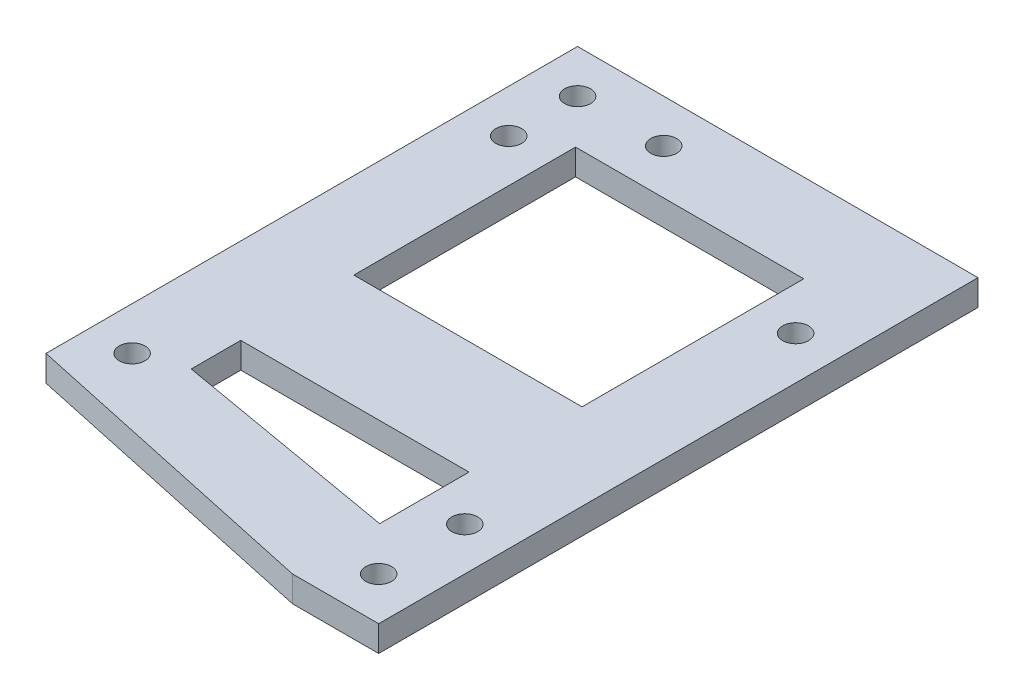
ISO-10303-21;
HEADER;
FILE_DESCRIPTION(('STEP AP214'),'2;1');
FILE_NAME('part.step','',(''),(''),'','','');
FILE_SCHEMA(('AUTOMOTIVE_DESIGN { 1 0 10303 214 1 1 1 1 }'));
ENDSEC;
DATA;
#1=APPLICATION_CONTEXT('core data for automotive mechanical design processes');
#2=APPLICATION_PROTOCOL_DEFINITION('international standard','automotive_design',2000,#1);
#3=PRODUCT_CONTEXT('',#1,'mechanical');
#4=PRODUCT('Part','Part','',(#3));
#5=PRODUCT_RELATED_PRODUCT_CATEGORY('part','',(#4));
#6=PRODUCT_DEFINITION_FORMATION('','',#4);
#7=PRODUCT_DEFINITION_CONTEXT('part definition',#1,'design');
#8=PRODUCT_DEFINITION('design','',#6,#7);
#9=PRODUCT_DEFINITION_SHAPE('','',#8);
#10=(LENGTH_UNIT() NAMED_UNIT(*) SI_UNIT(.MILLI.,.METRE.));
#11=(NAMED_UNIT(*) PLANE_ANGLE_UNIT() SI_UNIT($,.RADIAN.));
#12=(NAMED_UNIT(*) SI_UNIT($,.STERADIAN.) SOLID_ANGLE_UNIT());
#13=UNCERTAINTY_MEASURE_WITH_UNIT(LENGTH_MEASURE(1.E-05),#10,'distance_accuracy_value','');
#14=(GEOMETRIC_REPRESENTATION_CONTEXT(3) GLOBAL_UNCERTAINTY_ASSIGNED_CONTEXT((#13)) GLOBAL_UNIT_ASSIGNED_CONTEXT((#10,
#11,#12)) REPRESENTATION_CONTEXT('',''));
#15=CARTESIAN_POINT('',(0.,0.,0.));
#16=DIRECTION('',(0.,0.,1.));
#17=DIRECTION('',(1.,0.,0.));
#18=AXIS2_PLACEMENT_3D('',#15,#16,#17);
#19=CARTESIAN_POINT('',(31.5,3.,0.));
#20=DIRECTION('',(1.,0.,0.));
#21=DIRECTION('',(0.,0.,1.));
#22=AXIS2_PLACEMENT_3D('',#19,#20,#21);
#23=PLANE('',#22);
#24=DIRECTION('',(0.,0.,-1.));
#25=VECTOR('',#24,1.);
#26=CARTESIAN_POINT('',(31.5,0.,0.));
#27=LINE('',#26,#25);
#28=CARTESIAN_POINT('',(31.5,0.,54.4800000000001));
#29=VERTEX_POINT('',#28);
#30=CARTESIAN_POINT('',(31.5,0.,44.1090614886732));
#31=VERTEX_POINT('',#30);
#32=EDGE_CURVE('E163',#29,#31,#27,.T.);
#33=ORIENTED_EDGE('',*,*,#32,.F.);
#34=DIRECTION('',(0.,-1.,0.));
#35=VECTOR('',#34,1.);
#36=CARTESIAN_POINT('',(31.5,3.,54.4800000000001));
#37=LINE('',#36,#35);
#38=CARTESIAN_POINT('',(31.5,3.,54.4800000000001));
#39=VERTEX_POINT('',#38);
#40=EDGE_CURVE('E143',#39,#29,#37,.T.);
#41=ORIENTED_EDGE('',*,*,#40,.F.);
#42=DIRECTION('',(0.,0.,-1.));
#43=VECTOR('',#42,1.);
#44=CARTESIAN_POINT('',(31.5,3.,0.));
#45=LINE('',#44,#43);
#46=CARTESIAN_POINT('',(31.5,3.,44.1090614886732));
#47=VERTEX_POINT('',#46);
#48=EDGE_CURVE('E152',#39,#47,#45,.T.);
#49=ORIENTED_EDGE('',*,*,#48,.T.);
#50=DIRECTION('',(0.,1.,0.));
#51=VECTOR('',#50,1.);
#52=CARTESIAN_POINT('',(31.5,0.,44.1090614886732));
#53=LINE('',#52,#51);
#54=EDGE_CURVE('E212',#31,#47,#53,.T.);
#55=ORIENTED_EDGE('',*,*,#54,.F.);
#56=EDGE_LOOP('',(#33,#41,#49,#55));
#57=FACE_BOUND('',#56,.T.);
#58=ADVANCED_FACE('F43',(#57),#23,.F.);
#59=CARTESIAN_POINT('',(5.,3.,0.));
#60=DIRECTION('',(1.,0.,0.));
#61=DIRECTION('',(0.,0.,1.));
#62=AXIS2_PLACEMENT_3D('',#59,#60,#61);
#63=PLANE('',#62);
#64=DIRECTION('',(0.,1.,0.));
#65=VECTOR('',#64,1.);
#66=CARTESIAN_POINT('',(5.,0.,49.8670785525155));
#67=LINE('',#66,#65);
#68=CARTESIAN_POINT('',(5.,0.,49.8670785525155));
#69=VERTEX_POINT('',#68);
#70=CARTESIAN_POINT('',(5.,3.,49.8670785525155));
#71=VERTEX_POINT('',#70);
#72=EDGE_CURVE('E146',#69,#71,#67,.T.);
#73=ORIENTED_EDGE('',*,*,#72,.F.);
#74=DIRECTION('',(0.,0.,-1.));
#75=VECTOR('',#74,1.);
#76=CARTESIAN_POINT('',(5.,0.,0.));
#77=LINE('',#76,#75);
#78=CARTESIAN_POINT('',(5.,0.,44.1090614886732));
#79=VERTEX_POINT('',#78);
#80=EDGE_CURVE('E274',#69,#79,#77,.T.);
#81=ORIENTED_EDGE('',*,*,#80,.T.);
#82=DIRECTION('',(0.,1.,0.));
#83=VECTOR('',#82,1.);
#84=CARTESIAN_POINT('',(5.,0.,44.1090614886732));
#85=LINE('',#84,#83);
#86=CARTESIAN_POINT('',(5.,3.,44.1090614886732));
#87=VERTEX_POINT('',#86);
#88=EDGE_CURVE('E208',#79,#87,#85,.T.);
#89=ORIENTED_EDGE('',*,*,#88,.T.);
#90=DIRECTION('',(0.,0.,-1.));
#91=VECTOR('',#90,1.);
#92=CARTESIAN_POINT('',(5.,3.,0.));
#93=LINE('',#92,#91);
#94=EDGE_CURVE('E241',#71,#87,#93,.T.);
#95=ORIENTED_EDGE('',*,*,#94,.F.);
#96=EDGE_LOOP('',(#73,#81,#89,#95));
#97=FACE_BOUND('',#96,.T.);
#98=ADVANCED_FACE('F303',(#97),#63,.T.);
#99=CARTESIAN_POINT('',(31.5,3.,30.982012269488));
#100=VERTEX_POINT('',#99);
#101=CARTESIAN_POINT('',(31.5,3.,5.23402453897604));
#102=VERTEX_POINT('',#101);
#103=EDGE_CURVE('E160',#100,#102,#45,.T.);
#104=ORIENTED_EDGE('',*,*,#103,.T.);
#105=DIRECTION('',(0.,-1.,0.));
#106=VECTOR('',#105,1.);
#107=CARTESIAN_POINT('',(31.5,3.,5.23402453897604));
#108=LINE('',#107,#106);
#109=CARTESIAN_POINT('',(31.5,0.,5.23402453897604));
#110=VERTEX_POINT('',#109);
#111=EDGE_CURVE('E11',#102,#110,#108,.T.);
#112=ORIENTED_EDGE('',*,*,#111,.T.);
#113=CARTESIAN_POINT('',(31.5,0.,30.982012269488));
#114=VERTEX_POINT('',#113);
#115=EDGE_CURVE('E269',#114,#110,#27,.T.);
#116=ORIENTED_EDGE('',*,*,#115,.F.);
#117=DIRECTION('',(0.,1.,0.));
#118=VECTOR('',#117,1.);
#119=CARTESIAN_POINT('',(31.5,0.,30.982012269488));
#120=LINE('',#119,#118);
#121=EDGE_CURVE('E214',#114,#100,#120,.T.);
#122=ORIENTED_EDGE('',*,*,#121,.T.);
#123=EDGE_LOOP('',(#104,#112,#116,#122));
#124=FACE_BOUND('',#123,.T.);
#125=ADVANCED_FACE('F305',(#124),#23,.F.);
#126=CARTESIAN_POINT('',(0.,3.,5.23402453897604));
#127=DIRECTION('',(0.,0.,1.));
#128=DIRECTION('',(-1.,0.,0.));
#129=AXIS2_PLACEMENT_3D('',#126,#127,#128);
#130=PLANE('',#129);
#131=DIRECTION('',(1.,0.,0.));
#132=VECTOR('',#131,1.);
#133=CARTESIAN_POINT('',(0.,0.,5.23402453897604));
#134=LINE('',#133,#132);
#135=CARTESIAN_POINT('',(5.,0.,5.23402453897604));
#136=VERTEX_POINT('',#135);
#137=EDGE_CURVE('E271',#136,#110,#134,.T.);
#138=ORIENTED_EDGE('',*,*,#137,.T.);
#139=ORIENTED_EDGE('',*,*,#111,.F.);
#140=DIRECTION('',(1.,0.,0.));
#141=VECTOR('',#140,1.);
#142=CARTESIAN_POINT('',(0.,3.,5.23402453897604));
#143=LINE('',#142,#141);
#144=CARTESIAN_POINT('',(5.,3.,5.23402453897604));
#145=VERTEX_POINT('',#144);
#146=EDGE_CURVE('E159',#145,#102,#143,.T.);
#147=ORIENTED_EDGE('',*,*,#146,.F.);
#148=DIRECTION('',(0.,-1.,0.));
#149=VECTOR('',#148,1.);
#150=CARTESIAN_POINT('',(5.,3.,5.23402453897604));
#151=LINE('',#150,#149);
#152=EDGE_CURVE('E52',#145,#136,#151,.T.);
#153=ORIENTED_EDGE('',*,*,#152,.T.);
#154=EDGE_LOOP('',(#138,#139,#147,#153));
#155=FACE_BOUND('',#154,.T.);
#156=ADVANCED_FACE('F315',(#155),#130,.T.);
#157=DIRECTION('',(0.,1.,0.));
#158=VECTOR('',#157,1.);
#159=CARTESIAN_POINT('',(5.,0.,30.982012269488));
#160=LINE('',#159,#158);
#161=CARTESIAN_POINT('',(5.,0.,30.982012269488));
#162=VERTEX_POINT('',#161);
#163=CARTESIAN_POINT('',(5.,3.,30.982012269488));
#164=VERTEX_POINT('',#163);
#165=EDGE_CURVE('E205',#162,#164,#160,.T.);
#166=ORIENTED_EDGE('',*,*,#165,.F.);
#167=EDGE_CURVE('E273',#162,#136,#77,.T.);
#168=ORIENTED_EDGE('',*,*,#167,.T.);
#169=ORIENTED_EDGE('',*,*,#152,.F.);
#170=EDGE_CURVE('E240',#164,#145,#93,.T.);
#171=ORIENTED_EDGE('',*,*,#170,.F.);
#172=EDGE_LOOP('',(#166,#168,#169,#171));
#173=FACE_BOUND('',#172,.T.);
#174=ADVANCED_FACE('F311',(#173),#63,.T.);
#175=CARTESIAN_POINT('',(-5.,3.,0.));
#176=DIRECTION('',(1.,0.,0.));
#177=DIRECTION('',(0.,0.,1.));
#178=AXIS2_PLACEMENT_3D('',#175,#176,#177);
#179=PLANE('',#178);
#180=DIRECTION('',(0.,0.,-1.));
#181=VECTOR('',#180,1.);
#182=CARTESIAN_POINT('',(-5.,0.,0.));
#183=LINE('',#182,#181);
#184=CARTESIAN_POINT('',(-5.,0.,56.73));
#185=VERTEX_POINT('',#184);
#186=CARTESIAN_POINT('',(-5.,0.,-5.));
#187=VERTEX_POINT('',#186);
#188=EDGE_CURVE('E211',#185,#187,#183,.T.);
#189=ORIENTED_EDGE('',*,*,#188,.F.);
#190=DIRECTION('',(0.,-1.,0.));
#191=VECTOR('',#190,1.);
#192=CARTESIAN_POINT('',(-5.,3.,56.73));
#193=LINE('',#192,#191);
#194=CARTESIAN_POINT('',(-5.,3.,56.73));
#195=VERTEX_POINT('',#194);
#196=EDGE_CURVE('E175',#195,#185,#193,.T.);
#197=ORIENTED_EDGE('',*,*,#196,.F.);
#198=DIRECTION('',(0.,0.,-1.));
#199=VECTOR('',#198,1.);
#200=CARTESIAN_POINT('',(-5.,3.,0.));
#201=LINE('',#200,#199);
#202=CARTESIAN_POINT('',(-5.,3.,-5.));
#203=VERTEX_POINT('',#202);
#204=EDGE_CURVE('E217',#195,#203,#201,.T.);
#205=ORIENTED_EDGE('',*,*,#204,.T.);
#206=DIRECTION('',(0.,-1.,0.));
#207=VECTOR('',#206,1.);
#208=CARTESIAN_POINT('',(-5.,3.,-5.));
#209=LINE('',#208,#207);
#210=EDGE_CURVE('E164',#203,#187,#209,.T.);
#211=ORIENTED_EDGE('',*,*,#210,.T.);
#212=EDGE_LOOP('',(#189,#197,#205,#211));
#213=FACE_BOUND('',#212,.T.);
#214=ADVANCED_FACE('F45',(#213),#179,.F.);
#215=CARTESIAN_POINT('',(0.,3.,-5.));
#216=DIRECTION('',(0.,0.,1.));
#217=DIRECTION('',(-1.,0.,0.));
#218=AXIS2_PLACEMENT_3D('',#215,#216,#217);
#219=PLANE('',#218);
#220=DIRECTION('',(1.,0.,0.));
#221=VECTOR('',#220,1.);
#222=CARTESIAN_POINT('',(0.,0.,-5.));
#223=LINE('',#222,#221);
#224=CARTESIAN_POINT('',(41.5,0.,-5.));
#225=VERTEX_POINT('',#224);
#226=EDGE_CURVE('E250',#187,#225,#223,.T.);
#227=ORIENTED_EDGE('',*,*,#226,.F.);
#228=ORIENTED_EDGE('',*,*,#210,.F.);
#229=DIRECTION('',(1.,0.,0.));
#230=VECTOR('',#229,1.);
#231=CARTESIAN_POINT('',(0.,3.,-5.));
#232=LINE('',#231,#230);
#233=CARTESIAN_POINT('',(41.5,3.,-5.));
#234=VERTEX_POINT('',#233);
#235=EDGE_CURVE('E220',#203,#234,#232,.T.);
#236=ORIENTED_EDGE('',*,*,#235,.T.);
#237=DIRECTION('',(0.,-1.,0.));
#238=VECTOR('',#237,1.);
#239=CARTESIAN_POINT('',(41.5,3.,-5.));
#240=LINE('',#239,#238);
#241=EDGE_CURVE('E169',#234,#225,#240,.T.);
#242=ORIENTED_EDGE('',*,*,#241,.T.);
#243=EDGE_LOOP('',(#227,#228,#236,#242));
#244=FACE_BOUND('',#243,.T.);
#245=ADVANCED_FACE('F473',(#244),#219,.F.);
#246=CARTESIAN_POINT('',(41.5,3.,0.));
#247=DIRECTION('',(1.,0.,0.));
#248=DIRECTION('',(0.,0.,1.));
#249=AXIS2_PLACEMENT_3D('',#246,#247,#248);
#250=PLANE('',#249);
#251=DIRECTION('',(0.,0.,-1.));
#252=VECTOR('',#251,1.);
#253=CARTESIAN_POINT('',(41.5,0.,0.));
#254=LINE('',#253,#252);
#255=CARTESIAN_POINT('',(41.5,0.,64.6));
#256=VERTEX_POINT('',#255);
#257=EDGE_CURVE('E253',#256,#225,#254,.T.);
#258=ORIENTED_EDGE('',*,*,#257,.T.);
#259=ORIENTED_EDGE('',*,*,#241,.F.);
#260=DIRECTION('',(0.,0.,-1.));
#261=VECTOR('',#260,1.);
#262=CARTESIAN_POINT('',(41.5,3.,0.));
#263=LINE('',#262,#261);
#264=CARTESIAN_POINT('',(41.5,3.,64.6));
#265=VERTEX_POINT('',#264);
#266=EDGE_CURVE('E223',#265,#234,#263,.T.);
#267=ORIENTED_EDGE('',*,*,#266,.F.);
#268=DIRECTION('',(0.,-1.,0.));
#269=VECTOR('',#268,1.);
#270=CARTESIAN_POINT('',(41.5,3.,64.6));
#271=LINE('',#270,#269);
#272=EDGE_CURVE('E182',#265,#256,#271,.T.);
#273=ORIENTED_EDGE('',*,*,#272,.T.);
#274=EDGE_LOOP('',(#258,#259,#267,#273));
#275=FACE_BOUND('',#274,.T.);
#276=ADVANCED_FACE('F462',(#275),#250,.T.);
#277=CARTESIAN_POINT('',(0.,3.,64.6));
#278=DIRECTION('',(0.,0.,-1.));
#279=DIRECTION('',(1.,0.,0.));
#280=AXIS2_PLACEMENT_3D('',#277,#278,#279);
#281=PLANE('',#280);
#282=DIRECTION('',(-1.,0.,0.));
#283=VECTOR('',#282,1.);
#284=CARTESIAN_POINT('',(0.,0.,64.6));
#285=LINE('',#284,#283);
#286=CARTESIAN_POINT('',(31.5,0.,64.6));
#287=VERTEX_POINT('',#286);
#288=EDGE_CURVE('E255',#256,#287,#285,.T.);
#289=ORIENTED_EDGE('',*,*,#288,.F.);
#290=ORIENTED_EDGE('',*,*,#272,.F.);
#291=DIRECTION('',(-1.,0.,0.));
#292=VECTOR('',#291,1.);
#293=CARTESIAN_POINT('',(0.,3.,64.6));
#294=LINE('',#293,#292);
#295=CARTESIAN_POINT('',(31.5,3.,64.6));
#296=VERTEX_POINT('',#295);
#297=EDGE_CURVE('E225',#265,#296,#294,.T.);
#298=ORIENTED_EDGE('',*,*,#297,.T.);
#299=DIRECTION('',(0.,-1.,0.));
#300=VECTOR('',#299,1.);
#301=CARTESIAN_POINT('',(31.5,3.,64.6));
#302=LINE('',#301,#300);
#303=EDGE_CURVE('E178',#296,#287,#302,.T.);
#304=ORIENTED_EDGE('',*,*,#303,.T.);
#305=EDGE_LOOP('',(#289,#290,#298,#304));
#306=FACE_BOUND('',#305,.T.);
#307=ADVANCED_FACE('F451',(#306),#281,.F.);
#308=CARTESIAN_POINT('',(0.,3.,51.73));
#309=DIRECTION('',(0.,-1.,0.));
#310=DIRECTION('',(0.,0.,1.));
#311=AXIS2_PLACEMENT_3D('',#308,#309,#310);
#312=CYLINDRICAL_SURFACE('',#311,1.5);
#313=CARTESIAN_POINT('',(0.,3.,51.73));
#314=DIRECTION('',(0.,-1.,0.));
#315=DIRECTION('',(0.,0.,-1.));
#316=AXIS2_PLACEMENT_3D('',#313,#314,#315);
#317=CIRCLE('',#316,1.5);
#318=CARTESIAN_POINT('',(0.,3.,50.23));
#319=VERTEX_POINT('',#318);
#320=EDGE_CURVE('E243',#319,#319,#317,.T.);
#321=ORIENTED_EDGE('',*,*,#320,.F.);
#322=EDGE_LOOP('',(#321));
#323=FACE_BOUND('',#322,.T.);
#324=CARTESIAN_POINT('',(0.,0.,51.73));
#325=DIRECTION('',(0.,-1.,0.));
#326=DIRECTION('',(0.,0.,-1.));
#327=AXIS2_PLACEMENT_3D('',#324,#325,#326);
#328=CIRCLE('',#327,1.5);
#329=CARTESIAN_POINT('',(0.,0.,50.23));
#330=VERTEX_POINT('',#329);
#331=EDGE_CURVE('E276',#330,#330,#328,.T.);
#332=ORIENTED_EDGE('',*,*,#331,.T.);
#333=EDGE_LOOP('',(#332));
#334=FACE_BOUND('',#333,.T.);
#335=ADVANCED_FACE('F441',(#323,#334),#312,.F.);
#336=CARTESIAN_POINT('',(36.5,3.,49.6));
#337=DIRECTION('',(0.,-1.,0.));
#338=DIRECTION('',(0.,0.,1.));
#339=AXIS2_PLACEMENT_3D('',#336,#337,#338);
#340=CYLINDRICAL_SURFACE('',#339,1.5);
#341=CARTESIAN_POINT('',(36.5,3.,49.6));
#342=DIRECTION('',(0.,-1.,0.));
#343=DIRECTION('',(0.,0.,-1.));
#344=AXIS2_PLACEMENT_3D('',#341,#342,#343);
#345=CIRCLE('',#344,1.5);
#346=CARTESIAN_POINT('',(36.5,3.,48.1));
#347=VERTEX_POINT('',#346);
#348=EDGE_CURVE('E236',#347,#347,#345,.T.);
#349=ORIENTED_EDGE('',*,*,#348,.F.);
#350=EDGE_LOOP('',(#349));
#351=FACE_BOUND('',#350,.T.);
#352=CARTESIAN_POINT('',(36.5,0.,49.6));
#353=DIRECTION('',(0.,-1.,0.));
#354=DIRECTION('',(0.,0.,-1.));
#355=AXIS2_PLACEMENT_3D('',#352,#353,#354);
#356=CIRCLE('',#355,1.5);
#357=CARTESIAN_POINT('',(36.5,0.,48.1));
#358=VERTEX_POINT('',#357);
#359=EDGE_CURVE('E266',#358,#358,#356,.T.);
#360=ORIENTED_EDGE('',*,*,#359,.T.);
#361=EDGE_LOOP('',(#360));
#362=FACE_BOUND('',#361,.T.);
#363=ADVANCED_FACE('F430',(#351,#362),#340,.F.);
#364=CARTESIAN_POINT('',(36.5,3.,59.6));
#365=DIRECTION('',(0.,-1.,0.));
#366=DIRECTION('',(0.,0.,1.));
#367=AXIS2_PLACEMENT_3D('',#364,#365,#366);
#368=CYLINDRICAL_SURFACE('',#367,1.5);
#369=CARTESIAN_POINT('',(36.5,3.,59.6));
#370=DIRECTION('',(0.,-1.,0.));
#371=DIRECTION('',(0.,0.,-1.));
#372=AXIS2_PLACEMENT_3D('',#369,#370,#371);
#373=CIRCLE('',#372,1.5);
#374=CARTESIAN_POINT('',(36.5,3.,58.1));
#375=VERTEX_POINT('',#374);
#376=EDGE_CURVE('E233',#375,#375,#373,.T.);
#377=ORIENTED_EDGE('',*,*,#376,.F.);
#378=EDGE_LOOP('',(#377));
#379=FACE_BOUND('',#378,.T.);
#380=CARTESIAN_POINT('',(36.5,0.,59.6));
#381=DIRECTION('',(0.,-1.,0.));
#382=DIRECTION('',(0.,0.,-1.));
#383=AXIS2_PLACEMENT_3D('',#380,#381,#382);
#384=CIRCLE('',#383,1.5);
#385=CARTESIAN_POINT('',(36.5,0.,58.1));
#386=VERTEX_POINT('',#385);
#387=EDGE_CURVE('E263',#386,#386,#384,.T.);
#388=ORIENTED_EDGE('',*,*,#387,.T.);
#389=EDGE_LOOP('',(#388));
#390=FACE_BOUND('',#389,.T.);
#391=ADVANCED_FACE('F419',(#379,#390),#368,.F.);
#392=CARTESIAN_POINT('',(36.5,3.,11.18));
#393=DIRECTION('',(0.,-1.,0.));
#394=DIRECTION('',(0.,0.,1.));
#395=AXIS2_PLACEMENT_3D('',#392,#393,#394);
#396=CYLINDRICAL_SURFACE('',#395,1.5);
#397=CARTESIAN_POINT('',(36.5,3.,11.18));
#398=DIRECTION('',(0.,-1.,0.));
#399=DIRECTION('',(0.,0.,-1.));
#400=AXIS2_PLACEMENT_3D('',#397,#398,#399);
#401=CIRCLE('',#400,1.5);
#402=CARTESIAN_POINT('',(36.5,3.,9.67999999999999));
#403=VERTEX_POINT('',#402);
#404=EDGE_CURVE('E230',#403,#403,#401,.T.);
#405=ORIENTED_EDGE('',*,*,#404,.F.);
#406=EDGE_LOOP('',(#405));
#407=FACE_BOUND('',#406,.T.);
#408=CARTESIAN_POINT('',(36.5,0.,11.18));
#409=DIRECTION('',(0.,-1.,0.));
#410=DIRECTION('',(0.,0.,-1.));
#411=AXIS2_PLACEMENT_3D('',#408,#409,#410);
#412=CIRCLE('',#411,1.5);
#413=CARTESIAN_POINT('',(36.5,0.,9.67999999999999));
#414=VERTEX_POINT('',#413);
#415=EDGE_CURVE('E260',#414,#414,#412,.T.);
#416=ORIENTED_EDGE('',*,*,#415,.T.);
#417=EDGE_LOOP('',(#416));
#418=FACE_BOUND('',#417,.T.);
#419=ADVANCED_FACE('F408',(#407,#418),#396,.F.);
#420=CARTESIAN_POINT('',(-11.9106417152535,3.,55.2399520466015));
#421=DIRECTION('',(0.210772639150553,0.,-0.97753511168935));
#422=DIRECTION('',(0.977535111689351,0.,0.210772639150553));
#423=AXIS2_PLACEMENT_3D('',#420,#421,#422);
#424=PLANE('',#423);
#425=DIRECTION('',(-0.977535111689351,0.,-0.210772639150553));
#426=VECTOR('',#425,1.);
#427=CARTESIAN_POINT('',(-11.9106417152535,0.,55.2399520466015));
#428=LINE('',#427,#426);
#429=EDGE_CURVE('E258',#287,#185,#428,.T.);
#430=ORIENTED_EDGE('',*,*,#429,.F.);
#431=ORIENTED_EDGE('',*,*,#303,.F.);
#432=DIRECTION('',(-0.977535111689351,0.,-0.210772639150553));
#433=VECTOR('',#432,1.);
#434=CARTESIAN_POINT('',(-11.9106417152535,3.,55.2399520466015));
#435=LINE('',#434,#433);
#436=EDGE_CURVE('E228',#296,#195,#435,.T.);
#437=ORIENTED_EDGE('',*,*,#436,.T.);
#438=ORIENTED_EDGE('',*,*,#196,.T.);
#439=EDGE_LOOP('',(#430,#431,#437,#438));
#440=FACE_BOUND('',#439,.T.);
#441=ADVANCED_FACE('F397',(#440),#424,.F.);
#442=CARTESIAN_POINT('',(0.,3.,0.));
#443=DIRECTION('',(0.,-1.,0.));
#444=DIRECTION('',(0.,0.,1.));
#445=AXIS2_PLACEMENT_3D('',#442,#443,#444);
#446=CYLINDRICAL_SURFACE('',#445,1.5);
#447=CARTESIAN_POINT('',(0.,3.,0.));
#448=DIRECTION('',(0.,-1.,0.));
#449=DIRECTION('',(0.,0.,-1.));
#450=AXIS2_PLACEMENT_3D('',#447,#448,#449);
#451=CIRCLE('',#450,1.5);
#452=CARTESIAN_POINT('',(0.,3.,-1.5));
#453=VERTEX_POINT('',#452);
#454=EDGE_CURVE('E179',#453,#453,#451,.T.);
#455=ORIENTED_EDGE('',*,*,#454,.F.);
#456=EDGE_LOOP('',(#455));
#457=FACE_BOUND('',#456,.T.);
#458=CARTESIAN_POINT('',(0.,0.,0.));
#459=DIRECTION('',(0.,-1.,0.));
#460=DIRECTION('',(0.,0.,-1.));
#461=AXIS2_PLACEMENT_3D('',#458,#459,#460);
#462=CIRCLE('',#461,1.5);
#463=CARTESIAN_POINT('',(0.,0.,-1.5));
#464=VERTEX_POINT('',#463);
#465=EDGE_CURVE('E172',#464,#464,#462,.T.);
#466=ORIENTED_EDGE('',*,*,#465,.T.);
#467=EDGE_LOOP('',(#466));
#468=FACE_BOUND('',#467,.T.);
#469=ADVANCED_FACE('F283',(#457,#468),#446,.F.);
#470=CARTESIAN_POINT('',(0.,3.,0.));
#471=DIRECTION('',(0.,1.,0.));
#472=DIRECTION('',(0.,0.,-1.));
#473=AXIS2_PLACEMENT_3D('',#470,#471,#472);
#474=PLANE('',#473);
#475=CARTESIAN_POINT('',(0.,3.,8.));
#476=DIRECTION('',(0.,-1.,0.));
#477=DIRECTION('',(0.,0.,-1.));
#478=AXIS2_PLACEMENT_3D('',#475,#476,#477);
#479=CIRCLE('',#478,1.5);
#480=CARTESIAN_POINT('',(0.,3.,6.5));
#481=VERTEX_POINT('',#480);
#482=EDGE_CURVE('E197',#481,#481,#479,.T.);
#483=ORIENTED_EDGE('',*,*,#482,.T.);
#484=EDGE_LOOP('',(#483));
#485=FACE_BOUND('',#484,.T.);
#486=CARTESIAN_POINT('',(10.,3.,0.));
#487=DIRECTION('',(0.,-1.,0.));
#488=DIRECTION('',(0.,0.,-1.));
#489=AXIS2_PLACEMENT_3D('',#486,#487,#488);
#490=CIRCLE('',#489,1.5);
#491=CARTESIAN_POINT('',(10.,3.,-1.5));
#492=VERTEX_POINT('',#491);
#493=EDGE_CURVE('E188',#492,#492,#490,.T.);
#494=ORIENTED_EDGE('',*,*,#493,.T.);
#495=EDGE_LOOP('',(#494));
#496=FACE_BOUND('',#495,.T.);
#497=DIRECTION('',(0.985185223123837,0.,0.17149366209407));
#498=VECTOR('',#497,1.);
#499=CARTESIAN_POINT('',(5.,3.,49.8670785525155));
#500=LINE('',#499,#498);
#501=EDGE_CURVE('E139',#71,#39,#500,.T.);
#502=ORIENTED_EDGE('',*,*,#501,.F.);
#503=ORIENTED_EDGE('',*,*,#94,.T.);
#504=DIRECTION('',(-1.,0.,0.));
#505=VECTOR('',#504,1.);
#506=CARTESIAN_POINT('',(5.,3.,44.1090614886732));
#507=LINE('',#506,#505);
#508=EDGE_CURVE('E155',#47,#87,#507,.T.);
#509=ORIENTED_EDGE('',*,*,#508,.F.);
#510=ORIENTED_EDGE('',*,*,#48,.F.);
#511=EDGE_LOOP('',(#502,#503,#509,#510));
#512=FACE_BOUND('',#511,.T.);
#513=ORIENTED_EDGE('',*,*,#170,.T.);
#514=ORIENTED_EDGE('',*,*,#146,.T.);
#515=ORIENTED_EDGE('',*,*,#103,.F.);
#516=DIRECTION('',(1.,0.,0.));
#517=VECTOR('',#516,1.);
#518=CARTESIAN_POINT('',(31.5,3.,30.982012269488));
#519=LINE('',#518,#517);
#520=EDGE_CURVE('E68',#164,#100,#519,.T.);
#521=ORIENTED_EDGE('',*,*,#520,.F.);
#522=EDGE_LOOP('',(#513,#514,#515,#521));
#523=FACE_BOUND('',#522,.T.);
#524=ORIENTED_EDGE('',*,*,#204,.F.);
#525=ORIENTED_EDGE('',*,*,#436,.F.);
#526=ORIENTED_EDGE('',*,*,#297,.F.);
#527=ORIENTED_EDGE('',*,*,#266,.T.);
#528=ORIENTED_EDGE('',*,*,#235,.F.);
#529=EDGE_LOOP('',(#524,#525,#526,#527,#528));
#530=FACE_BOUND('',#529,.T.);
#531=ORIENTED_EDGE('',*,*,#404,.T.);
#532=EDGE_LOOP('',(#531));
#533=FACE_BOUND('',#532,.T.);
#534=ORIENTED_EDGE('',*,*,#376,.T.);
#535=EDGE_LOOP('',(#534));
#536=FACE_BOUND('',#535,.T.);
#537=ORIENTED_EDGE('',*,*,#348,.T.);
#538=EDGE_LOOP('',(#537));
#539=FACE_BOUND('',#538,.T.);
#540=ORIENTED_EDGE('',*,*,#320,.T.);
#541=EDGE_LOOP('',(#540));
#542=FACE_BOUND('',#541,.T.);
#543=ORIENTED_EDGE('',*,*,#454,.T.);
#544=EDGE_LOOP('',(#543));
#545=FACE_BOUND('',#544,.T.);
#546=ADVANCED_FACE('F153',(#485,#496,#512,#523,#530,#533,#536,#539,#542,#545),#474,.T.);
#547=CARTESIAN_POINT('',(0.,0.,0.));
#548=DIRECTION('',(0.,1.,0.));
#549=DIRECTION('',(0.,0.,-1.));
#550=AXIS2_PLACEMENT_3D('',#547,#548,#549);
#551=PLANE('',#550);
#552=CARTESIAN_POINT('',(0.,0.,8.));
#553=DIRECTION('',(0.,-1.,0.));
#554=DIRECTION('',(0.,0.,-1.));
#555=AXIS2_PLACEMENT_3D('',#552,#553,#554);
#556=CIRCLE('',#555,1.5);
#557=CARTESIAN_POINT('',(0.,0.,6.5));
#558=VERTEX_POINT('',#557);
#559=EDGE_CURVE('E47',#558,#558,#556,.T.);
#560=ORIENTED_EDGE('',*,*,#559,.F.);
#561=EDGE_LOOP('',(#560));
#562=FACE_BOUND('',#561,.T.);
#563=CARTESIAN_POINT('',(10.,0.,0.));
#564=DIRECTION('',(0.,-1.,0.));
#565=DIRECTION('',(0.,0.,-1.));
#566=AXIS2_PLACEMENT_3D('',#563,#564,#565);
#567=CIRCLE('',#566,1.5);
#568=CARTESIAN_POINT('',(10.,0.,-1.5));
#569=VERTEX_POINT('',#568);
#570=EDGE_CURVE('E186',#569,#569,#567,.T.);
#571=ORIENTED_EDGE('',*,*,#570,.F.);
#572=EDGE_LOOP('',(#571));
#573=FACE_BOUND('',#572,.T.);
#574=ORIENTED_EDGE('',*,*,#32,.T.);
#575=DIRECTION('',(-1.,0.,0.));
#576=VECTOR('',#575,1.);
#577=CARTESIAN_POINT('',(5.,0.,44.1090614886732));
#578=LINE('',#577,#576);
#579=EDGE_CURVE('E203',#31,#79,#578,.T.);
#580=ORIENTED_EDGE('',*,*,#579,.T.);
#581=ORIENTED_EDGE('',*,*,#80,.F.);
#582=DIRECTION('',(0.985185223123837,0.,0.17149366209407));
#583=VECTOR('',#582,1.);
#584=CARTESIAN_POINT('',(5.,0.,49.8670785525155));
#585=LINE('',#584,#583);
#586=EDGE_CURVE('E60',#69,#29,#585,.T.);
#587=ORIENTED_EDGE('',*,*,#586,.T.);
#588=EDGE_LOOP('',(#574,#580,#581,#587));
#589=FACE_BOUND('',#588,.T.);
#590=DIRECTION('',(1.,0.,0.));
#591=VECTOR('',#590,1.);
#592=CARTESIAN_POINT('',(31.5,0.,30.982012269488));
#593=LINE('',#592,#591);
#594=EDGE_CURVE('E201',#162,#114,#593,.T.);
#595=ORIENTED_EDGE('',*,*,#594,.T.);
#596=ORIENTED_EDGE('',*,*,#115,.T.);
#597=ORIENTED_EDGE('',*,*,#137,.F.);
#598=ORIENTED_EDGE('',*,*,#167,.F.);
#599=EDGE_LOOP('',(#595,#596,#597,#598));
#600=FACE_BOUND('',#599,.T.);
#601=ORIENTED_EDGE('',*,*,#188,.T.);
#602=ORIENTED_EDGE('',*,*,#226,.T.);
#603=ORIENTED_EDGE('',*,*,#257,.F.);
#604=ORIENTED_EDGE('',*,*,#288,.T.);
#605=ORIENTED_EDGE('',*,*,#429,.T.);
#606=EDGE_LOOP('',(#601,#602,#603,#604,#605));
#607=FACE_BOUND('',#606,.T.);
#608=ORIENTED_EDGE('',*,*,#415,.F.);
#609=EDGE_LOOP('',(#608));
#610=FACE_BOUND('',#609,.T.);
#611=ORIENTED_EDGE('',*,*,#387,.F.);
#612=EDGE_LOOP('',(#611));
#613=FACE_BOUND('',#612,.T.);
#614=ORIENTED_EDGE('',*,*,#359,.F.);
#615=EDGE_LOOP('',(#614));
#616=FACE_BOUND('',#615,.T.);
#617=ORIENTED_EDGE('',*,*,#331,.F.);
#618=EDGE_LOOP('',(#617));
#619=FACE_BOUND('',#618,.T.);
#620=ORIENTED_EDGE('',*,*,#465,.F.);
#621=EDGE_LOOP('',(#620));
#622=FACE_BOUND('',#621,.T.);
#623=ADVANCED_FACE('F285',(#562,#573,#589,#600,#607,#610,#613,#616,#619,#622),#551,.F.);
#624=CARTESIAN_POINT('',(5.,0.,44.1090614886732));
#625=DIRECTION('',(0.,0.,1.));
#626=DIRECTION('',(-1.,0.,0.));
#627=AXIS2_PLACEMENT_3D('',#624,#625,#626);
#628=PLANE('',#627);
#629=ORIENTED_EDGE('',*,*,#508,.T.);
#630=ORIENTED_EDGE('',*,*,#88,.F.);
#631=ORIENTED_EDGE('',*,*,#579,.F.);
#632=ORIENTED_EDGE('',*,*,#54,.T.);
#633=EDGE_LOOP('',(#629,#630,#631,#632));
#634=FACE_BOUND('',#633,.T.);
#635=ADVANCED_FACE('F287',(#634),#628,.T.);
#636=CARTESIAN_POINT('',(31.5,0.,30.982012269488));
#637=DIRECTION('',(0.,0.,-1.));
#638=DIRECTION('',(1.,0.,0.));
#639=AXIS2_PLACEMENT_3D('',#636,#637,#638);
#640=PLANE('',#639);
#641=ORIENTED_EDGE('',*,*,#520,.T.);
#642=ORIENTED_EDGE('',*,*,#121,.F.);
#643=ORIENTED_EDGE('',*,*,#594,.F.);
#644=ORIENTED_EDGE('',*,*,#165,.T.);
#645=EDGE_LOOP('',(#641,#642,#643,#644));
#646=FACE_BOUND('',#645,.T.);
#647=ADVANCED_FACE('F294',(#646),#640,.T.);
#648=CARTESIAN_POINT('',(5.,0.,49.8670785525155));
#649=DIRECTION('',(0.17149366209407,0.,-0.985185223123837));
#650=DIRECTION('',(0.985185223123837,0.,0.17149366209407));
#651=AXIS2_PLACEMENT_3D('',#648,#649,#650);
#652=PLANE('',#651);
#653=ORIENTED_EDGE('',*,*,#501,.T.);
#654=ORIENTED_EDGE('',*,*,#40,.T.);
#655=ORIENTED_EDGE('',*,*,#586,.F.);
#656=ORIENTED_EDGE('',*,*,#72,.T.);
#657=EDGE_LOOP('',(#653,#654,#655,#656));
#658=FACE_BOUND('',#657,.T.);
#659=ADVANCED_FACE('F141',(#658),#652,.T.);
#660=CARTESIAN_POINT('',(10.,-7.,0.));
#661=DIRECTION('',(0.,1.,0.));
#662=DIRECTION('',(0.,0.,-1.));
#663=AXIS2_PLACEMENT_3D('',#660,#661,#662);
#664=CYLINDRICAL_SURFACE('',#663,1.5);
#665=ORIENTED_EDGE('',*,*,#493,.F.);
#666=EDGE_LOOP('',(#665));
#667=FACE_BOUND('',#666,.T.);
#668=ORIENTED_EDGE('',*,*,#570,.T.);
#669=EDGE_LOOP('',(#668));
#670=FACE_BOUND('',#669,.T.);
#671=ADVANCED_FACE('F340',(#667,#670),#664,.F.);
#672=CARTESIAN_POINT('',(0.,-7.,8.));
#673=DIRECTION('',(0.,1.,0.));
#674=DIRECTION('',(0.,0.,-1.));
#675=AXIS2_PLACEMENT_3D('',#672,#673,#674);
#676=CYLINDRICAL_SURFACE('',#675,1.5);
#677=ORIENTED_EDGE('',*,*,#482,.F.);
#678=EDGE_LOOP('',(#677));
#679=FACE_BOUND('',#678,.T.);
#680=ORIENTED_EDGE('',*,*,#559,.T.);
#681=EDGE_LOOP('',(#680));
#682=FACE_BOUND('',#681,.T.);
#683=ADVANCED_FACE('F345',(#679,#682),#676,.F.);
#684=CLOSED_SHELL('',(#58,#98,#125,#156,#174,#214,#245,#276,#307,#335,#363,#391,#419,#441,#469,
#546,#623,#635,#647,#659,#671,#683));
#685=MANIFOLD_SOLID_BREP('B2',#684);
#686=ADVANCED_BREP_SHAPE_REPRESENTATION('',(#18,#685),#14);
#687=SHAPE_DEFINITION_REPRESENTATION(#9,#686);
ENDSEC;
END-ISO-10303-21;
